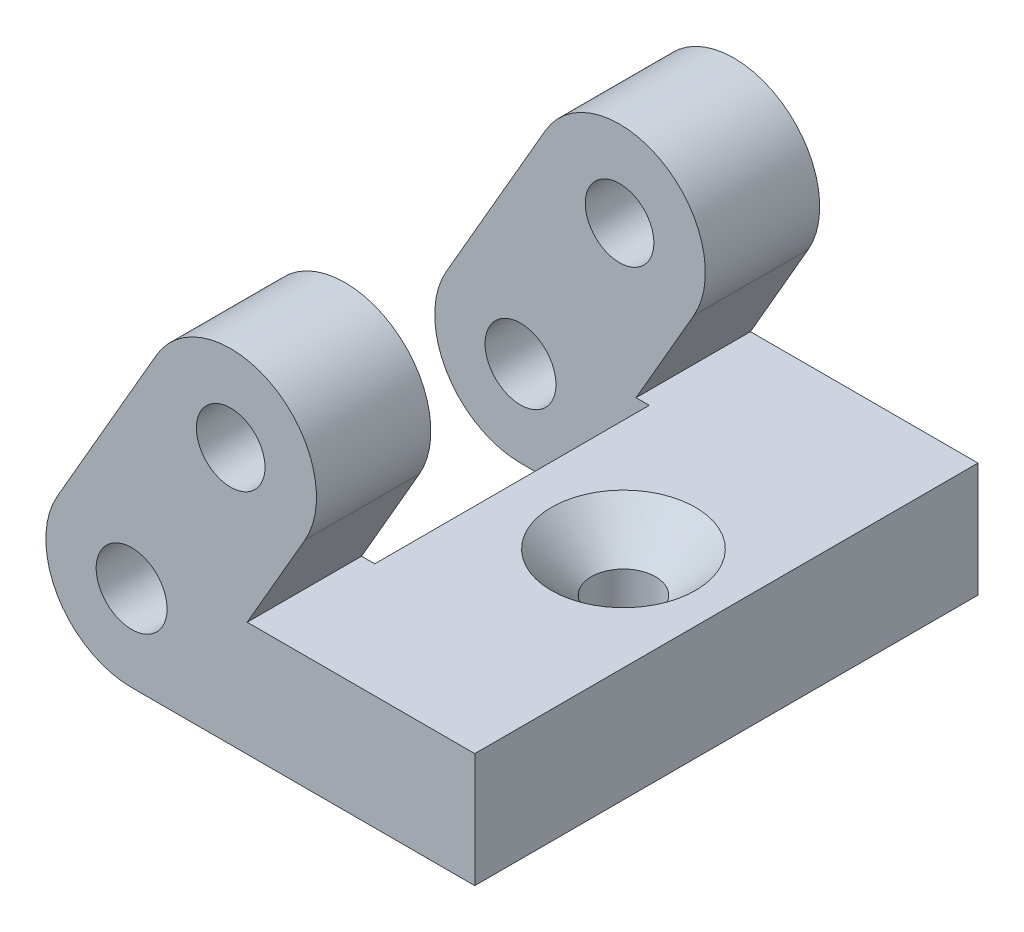
ISO-10303-21;
HEADER;
FILE_DESCRIPTION(('STEP AP214'),'2;1');
FILE_NAME('part.step','',(''),(''),'','','');
FILE_SCHEMA(('AUTOMOTIVE_DESIGN { 1 0 10303 214 1 1 1 1 }'));
ENDSEC;
DATA;
#1=APPLICATION_CONTEXT('core data for automotive mechanical design processes');
#2=APPLICATION_PROTOCOL_DEFINITION('international standard','automotive_design',2000,#1);
#3=PRODUCT_CONTEXT('',#1,'mechanical');
#4=PRODUCT('Part','Part','',(#3));
#5=PRODUCT_RELATED_PRODUCT_CATEGORY('part','',(#4));
#6=PRODUCT_DEFINITION_FORMATION('','',#4);
#7=PRODUCT_DEFINITION_CONTEXT('part definition',#1,'design');
#8=PRODUCT_DEFINITION('design','',#6,#7);
#9=PRODUCT_DEFINITION_SHAPE('','',#8);
#10=(LENGTH_UNIT() NAMED_UNIT(*) SI_UNIT(.MILLI.,.METRE.));
#11=(NAMED_UNIT(*) PLANE_ANGLE_UNIT() SI_UNIT($,.RADIAN.));
#12=(NAMED_UNIT(*) SI_UNIT($,.STERADIAN.) SOLID_ANGLE_UNIT());
#13=UNCERTAINTY_MEASURE_WITH_UNIT(LENGTH_MEASURE(1.E-05),#10,'distance_accuracy_value','');
#14=(GEOMETRIC_REPRESENTATION_CONTEXT(3) GLOBAL_UNCERTAINTY_ASSIGNED_CONTEXT((#13)) GLOBAL_UNIT_ASSIGNED_CONTEXT((#10,
#11,#12)) REPRESENTATION_CONTEXT('',''));
#15=CARTESIAN_POINT('',(0.,0.,0.));
#16=DIRECTION('',(0.,0.,1.));
#17=DIRECTION('',(1.,0.,0.));
#18=AXIS2_PLACEMENT_3D('',#15,#16,#17);
#19=CARTESIAN_POINT('',(4.33012701892224,7.5,-11.));
#20=DIRECTION('',(0.,0.,1.));
#21=DIRECTION('',(1.,0.,0.));
#22=AXIS2_PLACEMENT_3D('',#19,#20,#21);
#23=CYLINDRICAL_SURFACE('',#22,3.75);
#24=DIRECTION('',(0.,0.,1.));
#25=VECTOR('',#24,1.);
#26=CARTESIAN_POINT('',(1.0825317547306,9.37500000000002,-11.));
#27=LINE('',#26,#25);
#28=CARTESIAN_POINT('',(1.0825317547306,9.37500000000002,-11.));
#29=VERTEX_POINT('',#28);
#30=CARTESIAN_POINT('',(1.0825317547306,9.37500000000002,-6.));
#31=VERTEX_POINT('',#30);
#32=EDGE_CURVE('E284',#29,#31,#27,.T.);
#33=ORIENTED_EDGE('',*,*,#32,.T.);
#34=CARTESIAN_POINT('',(4.33012701892224,7.5,-6.));
#35=DIRECTION('',(0.,0.,1.));
#36=DIRECTION('',(1.,0.,0.));
#37=AXIS2_PLACEMENT_3D('',#34,#35,#36);
#38=CIRCLE('',#37,3.75);
#39=CARTESIAN_POINT('',(7.57772228311388,5.62499999999998,-6.));
#40=VERTEX_POINT('',#39);
#41=EDGE_CURVE('E201',#31,#40,#38,.F.);
#42=ORIENTED_EDGE('',*,*,#41,.T.);
#43=DIRECTION('',(0.,0.,1.));
#44=VECTOR('',#43,1.);
#45=CARTESIAN_POINT('',(7.57772228311388,5.62499999999998,-11.));
#46=LINE('',#45,#44);
#47=CARTESIAN_POINT('',(7.57772228311388,5.62499999999998,-11.));
#48=VERTEX_POINT('',#47);
#49=EDGE_CURVE('E264',#48,#40,#46,.T.);
#50=ORIENTED_EDGE('',*,*,#49,.F.);
#51=CARTESIAN_POINT('',(4.33012701892224,7.5,-11.));
#52=DIRECTION('',(0.,0.,1.));
#53=DIRECTION('',(-1.,0.,0.));
#54=AXIS2_PLACEMENT_3D('',#51,#52,#53);
#55=CIRCLE('',#54,3.75);
#56=EDGE_CURVE('E222',#48,#29,#55,.T.);
#57=ORIENTED_EDGE('',*,*,#56,.T.);
#58=EDGE_LOOP('',(#33,#42,#50,#57));
#59=FACE_BOUND('',#58,.T.);
#60=ADVANCED_FACE('F33',(#59),#23,.T.);
#61=CARTESIAN_POINT('',(5.05181485540925,1.25,-11.));
#62=DIRECTION('',(0.866025403784436,-0.500000000000004,0.));
#63=DIRECTION('',(0.500000000000004,0.866025403784436,0.));
#64=AXIS2_PLACEMENT_3D('',#61,#62,#63);
#65=PLANE('',#64);
#66=ORIENTED_EDGE('',*,*,#49,.T.);
#67=DIRECTION('',(-0.500000000000004,-0.866025403784436,0.));
#68=VECTOR('',#67,1.);
#69=CARTESIAN_POINT('',(5.05181485540925,1.25,-6.));
#70=LINE('',#69,#68);
#71=CARTESIAN_POINT('',(5.05181485540925,1.25,-6.));
#72=VERTEX_POINT('',#71);
#73=EDGE_CURVE('E204',#40,#72,#70,.T.);
#74=ORIENTED_EDGE('',*,*,#73,.T.);
#75=DIRECTION('',(0.,0.,1.));
#76=VECTOR('',#75,1.);
#77=CARTESIAN_POINT('',(5.05181485540925,1.25,-11.));
#78=LINE('',#77,#76);
#79=CARTESIAN_POINT('',(5.05181485540925,1.25,-11.));
#80=VERTEX_POINT('',#79);
#81=EDGE_CURVE('E268',#80,#72,#78,.T.);
#82=ORIENTED_EDGE('',*,*,#81,.F.);
#83=DIRECTION('',(0.500000000000004,0.866025403784436,0.));
#84=VECTOR('',#83,1.);
#85=CARTESIAN_POINT('',(5.05181485540925,1.25,-11.));
#86=LINE('',#85,#84);
#87=EDGE_CURVE('E241',#80,#48,#86,.T.);
#88=ORIENTED_EDGE('',*,*,#87,.T.);
#89=EDGE_LOOP('',(#66,#74,#82,#88));
#90=FACE_BOUND('',#89,.T.);
#91=ADVANCED_FACE('F320',(#90),#65,.T.);
#92=CARTESIAN_POINT('',(15.,1.25,-11.));
#93=DIRECTION('',(0.,1.,0.));
#94=DIRECTION('',(-1.,0.,0.));
#95=AXIS2_PLACEMENT_3D('',#92,#93,#94);
#96=PLANE('',#95);
#97=CARTESIAN_POINT('',(10.5,1.25,0.));
#98=DIRECTION('',(0.,1.,0.));
#99=DIRECTION('',(0.,0.,1.));
#100=AXIS2_PLACEMENT_3D('',#97,#98,#99);
#101=CIRCLE('',#100,3.15);
#102=CARTESIAN_POINT('',(10.5,1.25,3.15));
#103=VERTEX_POINT('',#102);
#104=EDGE_CURVE('E377',#103,#103,#101,.T.);
#105=ORIENTED_EDGE('',*,*,#104,.F.);
#106=EDGE_LOOP('',(#105));
#107=FACE_BOUND('',#106,.T.);
#108=ORIENTED_EDGE('',*,*,#81,.T.);
#109=DIRECTION('',(1.,0.,0.));
#110=VECTOR('',#109,1.);
#111=CARTESIAN_POINT('',(15.,1.25,-6.));
#112=LINE('',#111,#110);
#113=CARTESIAN_POINT('',(5.62916512459885,1.25,-6.));
#114=VERTEX_POINT('',#113);
#115=EDGE_CURVE('E207',#72,#114,#112,.T.);
#116=ORIENTED_EDGE('',*,*,#115,.T.);
#117=DIRECTION('',(0.,0.,-1.));
#118=VECTOR('',#117,1.);
#119=CARTESIAN_POINT('',(5.62916512459885,1.25,-11.));
#120=LINE('',#119,#118);
#121=CARTESIAN_POINT('',(5.62916512459885,1.25,6.));
#122=VERTEX_POINT('',#121);
#123=EDGE_CURVE('E169',#122,#114,#120,.T.);
#124=ORIENTED_EDGE('',*,*,#123,.F.);
#125=DIRECTION('',(1.,0.,0.));
#126=VECTOR('',#125,1.);
#127=CARTESIAN_POINT('',(15.,1.25,6.));
#128=LINE('',#127,#126);
#129=CARTESIAN_POINT('',(5.05181485540925,1.25,6.));
#130=VERTEX_POINT('',#129);
#131=EDGE_CURVE('E188',#130,#122,#128,.T.);
#132=ORIENTED_EDGE('',*,*,#131,.F.);
#133=CARTESIAN_POINT('',(5.05181485540925,1.25,11.));
#134=VERTEX_POINT('',#133);
#135=EDGE_CURVE('E271',#130,#134,#78,.T.);
#136=ORIENTED_EDGE('',*,*,#135,.T.);
#137=DIRECTION('',(-1.,0.,0.));
#138=VECTOR('',#137,1.);
#139=CARTESIAN_POINT('',(15.,1.25,11.));
#140=LINE('',#139,#138);
#141=CARTESIAN_POINT('',(15.,1.25,11.));
#142=VERTEX_POINT('',#141);
#143=EDGE_CURVE('E259',#142,#134,#140,.T.);
#144=ORIENTED_EDGE('',*,*,#143,.F.);
#145=DIRECTION('',(0.,0.,1.));
#146=VECTOR('',#145,1.);
#147=CARTESIAN_POINT('',(15.,1.25,-11.));
#148=LINE('',#147,#146);
#149=CARTESIAN_POINT('',(15.,1.25,-11.));
#150=VERTEX_POINT('',#149);
#151=EDGE_CURVE('E272',#150,#142,#148,.T.);
#152=ORIENTED_EDGE('',*,*,#151,.F.);
#153=DIRECTION('',(-1.,0.,0.));
#154=VECTOR('',#153,1.);
#155=CARTESIAN_POINT('',(15.,1.25,-11.));
#156=LINE('',#155,#154);
#157=EDGE_CURVE('E238',#150,#80,#156,.T.);
#158=ORIENTED_EDGE('',*,*,#157,.T.);
#159=EDGE_LOOP('',(#108,#116,#124,#132,#136,#144,#152,#158));
#160=FACE_BOUND('',#159,.T.);
#161=ADVANCED_FACE('F322',(#107,#160),#96,.T.);
#162=CARTESIAN_POINT('',(0.,-3.75,-11.));
#163=DIRECTION('',(0.,-1.,0.));
#164=DIRECTION('',(1.,0.,0.));
#165=AXIS2_PLACEMENT_3D('',#162,#163,#164);
#166=PLANE('',#165);
#167=CARTESIAN_POINT('',(10.5,-3.75,0.));
#168=DIRECTION('',(0.,-1.,0.));
#169=DIRECTION('',(1.,0.,0.));
#170=AXIS2_PLACEMENT_3D('',#167,#168,#169);
#171=CIRCLE('',#170,1.4);
#172=CARTESIAN_POINT('',(11.9,-3.75,0.));
#173=VERTEX_POINT('',#172);
#174=EDGE_CURVE('E174',#173,#173,#171,.T.);
#175=ORIENTED_EDGE('',*,*,#174,.F.);
#176=EDGE_LOOP('',(#175));
#177=FACE_BOUND('',#176,.T.);
#178=DIRECTION('',(-1.,0.,0.));
#179=VECTOR('',#178,1.);
#180=CARTESIAN_POINT('',(0.,-3.75,6.));
#181=LINE('',#180,#179);
#182=CARTESIAN_POINT('',(4.47213595499958,-3.75,6.));
#183=VERTEX_POINT('',#182);
#184=CARTESIAN_POINT('',(0.,-3.75,6.));
#185=VERTEX_POINT('',#184);
#186=EDGE_CURVE('E48',#183,#185,#181,.T.);
#187=ORIENTED_EDGE('',*,*,#186,.F.);
#188=DIRECTION('',(0.,0.,-1.));
#189=VECTOR('',#188,1.);
#190=CARTESIAN_POINT('',(4.47213595499958,-3.75,-6.));
#191=LINE('',#190,#189);
#192=CARTESIAN_POINT('',(4.47213595499958,-3.75,-6.));
#193=VERTEX_POINT('',#192);
#194=EDGE_CURVE('E297',#183,#193,#191,.T.);
#195=ORIENTED_EDGE('',*,*,#194,.T.);
#196=DIRECTION('',(-1.,0.,0.));
#197=VECTOR('',#196,1.);
#198=CARTESIAN_POINT('',(0.,-3.75,-6.));
#199=LINE('',#198,#197);
#200=CARTESIAN_POINT('',(0.,-3.75,-6.));
#201=VERTEX_POINT('',#200);
#202=EDGE_CURVE('E55',#193,#201,#199,.T.);
#203=ORIENTED_EDGE('',*,*,#202,.T.);
#204=DIRECTION('',(0.,0.,1.));
#205=VECTOR('',#204,1.);
#206=CARTESIAN_POINT('',(0.,-3.75,-11.));
#207=LINE('',#206,#205);
#208=CARTESIAN_POINT('',(0.,-3.75,-11.));
#209=VERTEX_POINT('',#208);
#210=EDGE_CURVE('E276',#209,#201,#207,.T.);
#211=ORIENTED_EDGE('',*,*,#210,.F.);
#212=DIRECTION('',(1.,0.,0.));
#213=VECTOR('',#212,1.);
#214=CARTESIAN_POINT('',(0.,-3.75,-11.));
#215=LINE('',#214,#213);
#216=CARTESIAN_POINT('',(15.,-3.75,-11.));
#217=VERTEX_POINT('',#216);
#218=EDGE_CURVE('E232',#209,#217,#215,.T.);
#219=ORIENTED_EDGE('',*,*,#218,.T.);
#220=DIRECTION('',(0.,0.,1.));
#221=VECTOR('',#220,1.);
#222=CARTESIAN_POINT('',(15.,-3.75,-11.));
#223=LINE('',#222,#221);
#224=CARTESIAN_POINT('',(15.,-3.75,11.));
#225=VERTEX_POINT('',#224);
#226=EDGE_CURVE('E274',#217,#225,#223,.T.);
#227=ORIENTED_EDGE('',*,*,#226,.T.);
#228=DIRECTION('',(1.,0.,0.));
#229=VECTOR('',#228,1.);
#230=CARTESIAN_POINT('',(0.,-3.75,11.));
#231=LINE('',#230,#229);
#232=CARTESIAN_POINT('',(0.,-3.75,11.));
#233=VERTEX_POINT('',#232);
#234=EDGE_CURVE('E253',#233,#225,#231,.T.);
#235=ORIENTED_EDGE('',*,*,#234,.F.);
#236=EDGE_CURVE('E279',#185,#233,#207,.T.);
#237=ORIENTED_EDGE('',*,*,#236,.F.);
#238=EDGE_LOOP('',(#187,#195,#203,#211,#219,#227,#235,#237));
#239=FACE_BOUND('',#238,.T.);
#240=ADVANCED_FACE('F304',(#177,#239),#166,.T.);
#241=CARTESIAN_POINT('',(0.,0.,-11.));
#242=DIRECTION('',(0.,0.,1.));
#243=DIRECTION('',(1.,0.,0.));
#244=AXIS2_PLACEMENT_3D('',#241,#242,#243);
#245=CYLINDRICAL_SURFACE('',#244,3.75);
#246=ORIENTED_EDGE('',*,*,#210,.T.);
#247=CARTESIAN_POINT('',(0.,0.,-6.));
#248=DIRECTION('',(0.,0.,1.));
#249=DIRECTION('',(1.,0.,0.));
#250=AXIS2_PLACEMENT_3D('',#247,#248,#249);
#251=CIRCLE('',#250,3.75);
#252=CARTESIAN_POINT('',(-3.24759526419164,1.87500000000002,-6.));
#253=VERTEX_POINT('',#252);
#254=EDGE_CURVE('E197',#201,#253,#251,.F.);
#255=ORIENTED_EDGE('',*,*,#254,.T.);
#256=DIRECTION('',(0.,0.,1.));
#257=VECTOR('',#256,1.);
#258=CARTESIAN_POINT('',(-3.24759526419164,1.87500000000002,-11.));
#259=LINE('',#258,#257);
#260=CARTESIAN_POINT('',(-3.24759526419164,1.87500000000002,-11.));
#261=VERTEX_POINT('',#260);
#262=EDGE_CURVE('E280',#261,#253,#259,.T.);
#263=ORIENTED_EDGE('',*,*,#262,.F.);
#264=CARTESIAN_POINT('',(0.,0.,-11.));
#265=DIRECTION('',(0.,0.,1.));
#266=DIRECTION('',(1.,0.,0.));
#267=AXIS2_PLACEMENT_3D('',#264,#265,#266);
#268=CIRCLE('',#267,3.75);
#269=EDGE_CURVE('E229',#261,#209,#268,.T.);
#270=ORIENTED_EDGE('',*,*,#269,.T.);
#271=EDGE_LOOP('',(#246,#255,#263,#270));
#272=FACE_BOUND('',#271,.T.);
#273=ADVANCED_FACE('F307',(#272),#245,.T.);
#274=CARTESIAN_POINT('',(1.0825317547306,9.37500000000002,-11.));
#275=DIRECTION('',(-0.866025403784436,0.500000000000004,0.));
#276=DIRECTION('',(-0.500000000000004,-0.866025403784436,0.));
#277=AXIS2_PLACEMENT_3D('',#274,#275,#276);
#278=PLANE('',#277);
#279=ORIENTED_EDGE('',*,*,#262,.T.);
#280=DIRECTION('',(0.500000000000004,0.866025403784436,0.));
#281=VECTOR('',#280,1.);
#282=CARTESIAN_POINT('',(1.0825317547306,9.37500000000002,-6.));
#283=LINE('',#282,#281);
#284=EDGE_CURVE('E194',#253,#31,#283,.T.);
#285=ORIENTED_EDGE('',*,*,#284,.T.);
#286=ORIENTED_EDGE('',*,*,#32,.F.);
#287=DIRECTION('',(-0.500000000000004,-0.866025403784436,0.));
#288=VECTOR('',#287,1.);
#289=CARTESIAN_POINT('',(1.0825317547306,9.37500000000002,-11.));
#290=LINE('',#289,#288);
#291=EDGE_CURVE('E225',#29,#261,#290,.T.);
#292=ORIENTED_EDGE('',*,*,#291,.T.);
#293=EDGE_LOOP('',(#279,#285,#286,#292));
#294=FACE_BOUND('',#293,.T.);
#295=ADVANCED_FACE('F315',(#294),#278,.T.);
#296=CARTESIAN_POINT('',(0.,0.,-11.));
#297=DIRECTION('',(0.,0.,1.));
#298=DIRECTION('',(1.,0.,0.));
#299=AXIS2_PLACEMENT_3D('',#296,#297,#298);
#300=CYLINDRICAL_SURFACE('',#299,1.55);
#301=CARTESIAN_POINT('',(0.,0.,-11.));
#302=DIRECTION('',(0.,0.,1.));
#303=DIRECTION('',(1.,0.,0.));
#304=AXIS2_PLACEMENT_3D('',#301,#302,#303);
#305=CIRCLE('',#304,1.55);
#306=CARTESIAN_POINT('',(1.55,0.,-11.));
#307=VERTEX_POINT('',#306);
#308=EDGE_CURVE('E216',#307,#307,#305,.T.);
#309=ORIENTED_EDGE('',*,*,#308,.F.);
#310=EDGE_LOOP('',(#309));
#311=FACE_BOUND('',#310,.T.);
#312=CARTESIAN_POINT('',(0.,0.,-6.));
#313=DIRECTION('',(0.,0.,1.));
#314=DIRECTION('',(1.,0.,0.));
#315=AXIS2_PLACEMENT_3D('',#312,#313,#314);
#316=CIRCLE('',#315,1.55);
#317=CARTESIAN_POINT('',(1.55,0.,-6.));
#318=VERTEX_POINT('',#317);
#319=EDGE_CURVE('E191',#318,#318,#316,.F.);
#320=ORIENTED_EDGE('',*,*,#319,.F.);
#321=EDGE_LOOP('',(#320));
#322=FACE_BOUND('',#321,.T.);
#323=ADVANCED_FACE('F412',(#311,#322),#300,.F.);
#324=CARTESIAN_POINT('',(4.33012701892224,7.5,-11.));
#325=DIRECTION('',(0.,0.,1.));
#326=DIRECTION('',(1.,0.,0.));
#327=AXIS2_PLACEMENT_3D('',#324,#325,#326);
#328=CYLINDRICAL_SURFACE('',#327,1.5);
#329=CARTESIAN_POINT('',(4.33012701892224,7.5,-11.));
#330=DIRECTION('',(0.,0.,1.));
#331=DIRECTION('',(1.,0.,0.));
#332=AXIS2_PLACEMENT_3D('',#329,#330,#331);
#333=CIRCLE('',#332,1.5);
#334=CARTESIAN_POINT('',(5.83012701892224,7.5,-11.));
#335=VERTEX_POINT('',#334);
#336=EDGE_CURVE('E210',#335,#335,#333,.T.);
#337=ORIENTED_EDGE('',*,*,#336,.F.);
#338=EDGE_LOOP('',(#337));
#339=FACE_BOUND('',#338,.T.);
#340=CARTESIAN_POINT('',(4.33012701892224,7.5,-6.));
#341=DIRECTION('',(0.,0.,1.));
#342=DIRECTION('',(1.,0.,0.));
#343=AXIS2_PLACEMENT_3D('',#340,#341,#342);
#344=CIRCLE('',#343,1.5);
#345=CARTESIAN_POINT('',(5.83012701892224,7.5,-6.));
#346=VERTEX_POINT('',#345);
#347=EDGE_CURVE('E190',#346,#346,#344,.F.);
#348=ORIENTED_EDGE('',*,*,#347,.F.);
#349=EDGE_LOOP('',(#348));
#350=FACE_BOUND('',#349,.T.);
#351=ADVANCED_FACE('F357',(#339,#350),#328,.F.);
#352=CARTESIAN_POINT('',(4.33012701892224,7.5,6.));
#353=DIRECTION('',(0.,0.,1.));
#354=DIRECTION('',(1.,0.,0.));
#355=AXIS2_PLACEMENT_3D('',#352,#353,#354);
#356=CIRCLE('',#355,3.75);
#357=CARTESIAN_POINT('',(1.0825317547306,9.37500000000002,6.));
#358=VERTEX_POINT('',#357);
#359=CARTESIAN_POINT('',(7.57772228311388,5.62499999999998,6.));
#360=VERTEX_POINT('',#359);
#361=EDGE_CURVE('E184',#358,#360,#356,.F.);
#362=ORIENTED_EDGE('',*,*,#361,.F.);
#363=CARTESIAN_POINT('',(1.0825317547306,9.37500000000002,11.));
#364=VERTEX_POINT('',#363);
#365=EDGE_CURVE('E244',#358,#364,#27,.T.);
#366=ORIENTED_EDGE('',*,*,#365,.T.);
#367=CARTESIAN_POINT('',(4.33012701892224,7.5,11.));
#368=DIRECTION('',(0.,0.,1.));
#369=DIRECTION('',(-1.,0.,0.));
#370=AXIS2_PLACEMENT_3D('',#367,#368,#369);
#371=CIRCLE('',#370,3.75);
#372=CARTESIAN_POINT('',(7.57772228311388,5.62499999999998,11.));
#373=VERTEX_POINT('',#372);
#374=EDGE_CURVE('E219',#373,#364,#371,.T.);
#375=ORIENTED_EDGE('',*,*,#374,.F.);
#376=EDGE_CURVE('E267',#360,#373,#46,.T.);
#377=ORIENTED_EDGE('',*,*,#376,.F.);
#378=EDGE_LOOP('',(#362,#366,#375,#377));
#379=FACE_BOUND('',#378,.T.);
#380=ADVANCED_FACE('F342',(#379),#23,.T.);
#381=DIRECTION('',(-0.500000000000004,-0.866025403784436,0.));
#382=VECTOR('',#381,1.);
#383=CARTESIAN_POINT('',(5.05181485540925,1.25,6.));
#384=LINE('',#383,#382);
#385=EDGE_CURVE('E186',#360,#130,#384,.T.);
#386=ORIENTED_EDGE('',*,*,#385,.F.);
#387=ORIENTED_EDGE('',*,*,#376,.T.);
#388=DIRECTION('',(0.500000000000004,0.866025403784436,0.));
#389=VECTOR('',#388,1.);
#390=CARTESIAN_POINT('',(5.05181485540925,1.25,11.));
#391=LINE('',#390,#389);
#392=EDGE_CURVE('E226',#134,#373,#391,.T.);
#393=ORIENTED_EDGE('',*,*,#392,.F.);
#394=ORIENTED_EDGE('',*,*,#135,.F.);
#395=EDGE_LOOP('',(#386,#387,#393,#394));
#396=FACE_BOUND('',#395,.T.);
#397=ADVANCED_FACE('F348',(#396),#65,.T.);
#398=CARTESIAN_POINT('',(15.,-3.75,-11.));
#399=DIRECTION('',(1.,0.,0.));
#400=DIRECTION('',(0.,0.,-1.));
#401=AXIS2_PLACEMENT_3D('',#398,#399,#400);
#402=PLANE('',#401);
#403=DIRECTION('',(0.,1.,0.));
#404=VECTOR('',#403,1.);
#405=CARTESIAN_POINT('',(15.,-3.75,11.));
#406=LINE('',#405,#404);
#407=EDGE_CURVE('E256',#225,#142,#406,.T.);
#408=ORIENTED_EDGE('',*,*,#407,.F.);
#409=ORIENTED_EDGE('',*,*,#226,.F.);
#410=DIRECTION('',(0.,1.,0.));
#411=VECTOR('',#410,1.);
#412=CARTESIAN_POINT('',(15.,-3.75,-11.));
#413=LINE('',#412,#411);
#414=EDGE_CURVE('E235',#217,#150,#413,.T.);
#415=ORIENTED_EDGE('',*,*,#414,.T.);
#416=ORIENTED_EDGE('',*,*,#151,.T.);
#417=EDGE_LOOP('',(#408,#409,#415,#416));
#418=FACE_BOUND('',#417,.T.);
#419=ADVANCED_FACE('F326',(#418),#402,.T.);
#420=CARTESIAN_POINT('',(0.,0.,6.));
#421=DIRECTION('',(0.,0.,1.));
#422=DIRECTION('',(1.,0.,0.));
#423=AXIS2_PLACEMENT_3D('',#420,#421,#422);
#424=CIRCLE('',#423,3.75);
#425=CARTESIAN_POINT('',(-3.24759526419164,1.87500000000002,6.));
#426=VERTEX_POINT('',#425);
#427=EDGE_CURVE('E181',#185,#426,#424,.F.);
#428=ORIENTED_EDGE('',*,*,#427,.F.);
#429=ORIENTED_EDGE('',*,*,#236,.T.);
#430=CARTESIAN_POINT('',(0.,0.,11.));
#431=DIRECTION('',(0.,0.,1.));
#432=DIRECTION('',(1.,0.,0.));
#433=AXIS2_PLACEMENT_3D('',#430,#431,#432);
#434=CIRCLE('',#433,3.75);
#435=CARTESIAN_POINT('',(-3.24759526419164,1.87500000000002,11.));
#436=VERTEX_POINT('',#435);
#437=EDGE_CURVE('E250',#436,#233,#434,.T.);
#438=ORIENTED_EDGE('',*,*,#437,.F.);
#439=EDGE_CURVE('E283',#426,#436,#259,.T.);
#440=ORIENTED_EDGE('',*,*,#439,.F.);
#441=EDGE_LOOP('',(#428,#429,#438,#440));
#442=FACE_BOUND('',#441,.T.);
#443=ADVANCED_FACE('F334',(#442),#245,.T.);
#444=DIRECTION('',(0.500000000000004,0.866025403784436,0.));
#445=VECTOR('',#444,1.);
#446=CARTESIAN_POINT('',(1.0825317547306,9.37500000000002,6.));
#447=LINE('',#446,#445);
#448=EDGE_CURVE('E179',#426,#358,#447,.T.);
#449=ORIENTED_EDGE('',*,*,#448,.F.);
#450=ORIENTED_EDGE('',*,*,#439,.T.);
#451=DIRECTION('',(-0.500000000000004,-0.866025403784436,0.));
#452=VECTOR('',#451,1.);
#453=CARTESIAN_POINT('',(1.0825317547306,9.37500000000002,11.));
#454=LINE('',#453,#452);
#455=EDGE_CURVE('E247',#364,#436,#454,.T.);
#456=ORIENTED_EDGE('',*,*,#455,.F.);
#457=ORIENTED_EDGE('',*,*,#365,.F.);
#458=EDGE_LOOP('',(#449,#450,#456,#457));
#459=FACE_BOUND('',#458,.T.);
#460=ADVANCED_FACE('F339',(#459),#278,.T.);
#461=CARTESIAN_POINT('',(4.33012701892224,7.5,-11.));
#462=DIRECTION('',(0.,0.,-1.));
#463=DIRECTION('',(-1.,0.,0.));
#464=AXIS2_PLACEMENT_3D('',#461,#462,#463);
#465=PLANE('',#464);
#466=ORIENTED_EDGE('',*,*,#336,.T.);
#467=EDGE_LOOP('',(#466));
#468=FACE_BOUND('',#467,.T.);
#469=ORIENTED_EDGE('',*,*,#308,.T.);
#470=EDGE_LOOP('',(#469));
#471=FACE_BOUND('',#470,.T.);
#472=ORIENTED_EDGE('',*,*,#56,.F.);
#473=ORIENTED_EDGE('',*,*,#87,.F.);
#474=ORIENTED_EDGE('',*,*,#157,.F.);
#475=ORIENTED_EDGE('',*,*,#414,.F.);
#476=ORIENTED_EDGE('',*,*,#218,.F.);
#477=ORIENTED_EDGE('',*,*,#269,.F.);
#478=ORIENTED_EDGE('',*,*,#291,.F.);
#479=EDGE_LOOP('',(#472,#473,#474,#475,#476,#477,#478));
#480=FACE_BOUND('',#479,.T.);
#481=ADVANCED_FACE('F312',(#468,#471,#480),#465,.T.);
#482=CARTESIAN_POINT('',(4.33012701892224,7.5,11.));
#483=DIRECTION('',(0.,0.,-1.));
#484=DIRECTION('',(-1.,0.,0.));
#485=AXIS2_PLACEMENT_3D('',#482,#483,#484);
#486=PLANE('',#485);
#487=CARTESIAN_POINT('',(4.33012701892224,7.5,11.));
#488=DIRECTION('',(0.,0.,1.));
#489=DIRECTION('',(1.,0.,0.));
#490=AXIS2_PLACEMENT_3D('',#487,#488,#489);
#491=CIRCLE('',#490,1.5);
#492=CARTESIAN_POINT('',(5.83012701892224,7.5,11.));
#493=VERTEX_POINT('',#492);
#494=EDGE_CURVE('E209',#493,#493,#491,.T.);
#495=ORIENTED_EDGE('',*,*,#494,.F.);
#496=EDGE_LOOP('',(#495));
#497=FACE_BOUND('',#496,.T.);
#498=CARTESIAN_POINT('',(0.,0.,11.));
#499=DIRECTION('',(0.,0.,1.));
#500=DIRECTION('',(1.,0.,0.));
#501=AXIS2_PLACEMENT_3D('',#498,#499,#500);
#502=CIRCLE('',#501,1.55);
#503=CARTESIAN_POINT('',(1.55,0.,11.));
#504=VERTEX_POINT('',#503);
#505=EDGE_CURVE('E213',#504,#504,#502,.T.);
#506=ORIENTED_EDGE('',*,*,#505,.F.);
#507=EDGE_LOOP('',(#506));
#508=FACE_BOUND('',#507,.T.);
#509=ORIENTED_EDGE('',*,*,#374,.T.);
#510=ORIENTED_EDGE('',*,*,#455,.T.);
#511=ORIENTED_EDGE('',*,*,#437,.T.);
#512=ORIENTED_EDGE('',*,*,#234,.T.);
#513=ORIENTED_EDGE('',*,*,#407,.T.);
#514=ORIENTED_EDGE('',*,*,#143,.T.);
#515=ORIENTED_EDGE('',*,*,#392,.T.);
#516=EDGE_LOOP('',(#509,#510,#511,#512,#513,#514,#515));
#517=FACE_BOUND('',#516,.T.);
#518=ADVANCED_FACE('F330',(#497,#508,#517),#486,.F.);
#519=CARTESIAN_POINT('',(0.,0.,6.));
#520=DIRECTION('',(0.,0.,1.));
#521=DIRECTION('',(1.,0.,0.));
#522=AXIS2_PLACEMENT_3D('',#519,#520,#521);
#523=CIRCLE('',#522,1.55);
#524=CARTESIAN_POINT('',(1.55,0.,6.));
#525=VERTEX_POINT('',#524);
#526=EDGE_CURVE('E176',#525,#525,#523,.F.);
#527=ORIENTED_EDGE('',*,*,#526,.T.);
#528=EDGE_LOOP('',(#527));
#529=FACE_BOUND('',#528,.T.);
#530=ORIENTED_EDGE('',*,*,#505,.T.);
#531=EDGE_LOOP('',(#530));
#532=FACE_BOUND('',#531,.T.);
#533=ADVANCED_FACE('F407',(#529,#532),#300,.F.);
#534=CARTESIAN_POINT('',(4.33012701892224,7.5,6.));
#535=DIRECTION('',(0.,0.,1.));
#536=DIRECTION('',(1.,0.,0.));
#537=AXIS2_PLACEMENT_3D('',#534,#535,#536);
#538=CIRCLE('',#537,1.5);
#539=CARTESIAN_POINT('',(5.83012701892224,7.5,6.));
#540=VERTEX_POINT('',#539);
#541=EDGE_CURVE('E165',#540,#540,#538,.F.);
#542=ORIENTED_EDGE('',*,*,#541,.T.);
#543=EDGE_LOOP('',(#542));
#544=FACE_BOUND('',#543,.T.);
#545=ORIENTED_EDGE('',*,*,#494,.T.);
#546=EDGE_LOOP('',(#545));
#547=FACE_BOUND('',#546,.T.);
#548=ADVANCED_FACE('F397',(#544,#547),#328,.F.);
#549=CARTESIAN_POINT('',(0.,0.,-6.));
#550=DIRECTION('',(0.,0.,1.));
#551=DIRECTION('',(1.,0.,0.));
#552=AXIS2_PLACEMENT_3D('',#549,#550,#551);
#553=PLANE('',#552);
#554=ORIENTED_EDGE('',*,*,#347,.T.);
#555=EDGE_LOOP('',(#554));
#556=FACE_BOUND('',#555,.T.);
#557=ORIENTED_EDGE('',*,*,#73,.F.);
#558=ORIENTED_EDGE('',*,*,#41,.F.);
#559=ORIENTED_EDGE('',*,*,#284,.F.);
#560=ORIENTED_EDGE('',*,*,#254,.F.);
#561=ORIENTED_EDGE('',*,*,#202,.F.);
#562=CARTESIAN_POINT('',(4.47213595499958,-2.75,-6.));
#563=DIRECTION('',(0.,0.,1.));
#564=DIRECTION('',(1.,0.,0.));
#565=AXIS2_PLACEMENT_3D('',#562,#563,#564);
#566=CIRCLE('',#565,1.);
#567=CARTESIAN_POINT('',(3.62030053499966,-2.22619047619048,-6.));
#568=VERTEX_POINT('',#567);
#569=EDGE_CURVE('E11',#193,#568,#566,.F.);
#570=ORIENTED_EDGE('',*,*,#569,.T.);
#571=CARTESIAN_POINT('',(0.,0.,-6.));
#572=DIRECTION('',(0.,0.,1.));
#573=DIRECTION('',(1.,0.,0.));
#574=AXIS2_PLACEMENT_3D('',#571,#572,#573);
#575=CIRCLE('',#574,4.25);
#576=CARTESIAN_POINT('',(3.68060796608386,-2.125,-6.));
#577=VERTEX_POINT('',#576);
#578=EDGE_CURVE('E144',#568,#577,#575,.T.);
#579=ORIENTED_EDGE('',*,*,#578,.T.);
#580=DIRECTION('',(0.5,0.866025403784439,0.));
#581=VECTOR('',#580,1.);
#582=CARTESIAN_POINT('',(13.3598428687312,14.6399266297792,-6.));
#583=LINE('',#582,#581);
#584=EDGE_CURVE('E149',#577,#114,#583,.T.);
#585=ORIENTED_EDGE('',*,*,#584,.T.);
#586=ORIENTED_EDGE('',*,*,#115,.F.);
#587=EDGE_LOOP('',(#557,#558,#559,#560,#561,#570,#579,#585,#586));
#588=FACE_BOUND('',#587,.T.);
#589=ORIENTED_EDGE('',*,*,#319,.T.);
#590=EDGE_LOOP('',(#589));
#591=FACE_BOUND('',#590,.T.);
#592=ADVANCED_FACE('F146',(#556,#588,#591),#553,.T.);
#593=CARTESIAN_POINT('',(0.,0.,6.));
#594=DIRECTION('',(0.,0.,1.));
#595=DIRECTION('',(1.,0.,0.));
#596=AXIS2_PLACEMENT_3D('',#593,#594,#595);
#597=PLANE('',#596);
#598=ORIENTED_EDGE('',*,*,#131,.T.);
#599=DIRECTION('',(0.5,0.866025403784439,0.));
#600=VECTOR('',#599,1.);
#601=CARTESIAN_POINT('',(13.3598428687312,14.6399266297792,6.));
#602=LINE('',#601,#600);
#603=CARTESIAN_POINT('',(3.68060796608386,-2.125,6.));
#604=VERTEX_POINT('',#603);
#605=EDGE_CURVE('E155',#604,#122,#602,.T.);
#606=ORIENTED_EDGE('',*,*,#605,.F.);
#607=CARTESIAN_POINT('',(0.,0.,6.));
#608=DIRECTION('',(0.,0.,1.));
#609=DIRECTION('',(1.,0.,0.));
#610=AXIS2_PLACEMENT_3D('',#607,#608,#609);
#611=CIRCLE('',#610,4.25);
#612=CARTESIAN_POINT('',(3.62030053499966,-2.22619047619048,6.));
#613=VERTEX_POINT('',#612);
#614=EDGE_CURVE('E161',#613,#604,#611,.T.);
#615=ORIENTED_EDGE('',*,*,#614,.F.);
#616=CARTESIAN_POINT('',(4.47213595499958,-2.75,6.));
#617=DIRECTION('',(0.,0.,1.));
#618=DIRECTION('',(1.,0.,0.));
#619=AXIS2_PLACEMENT_3D('',#616,#617,#618);
#620=CIRCLE('',#619,1.);
#621=EDGE_CURVE('E41',#613,#183,#620,.T.);
#622=ORIENTED_EDGE('',*,*,#621,.T.);
#623=ORIENTED_EDGE('',*,*,#186,.T.);
#624=ORIENTED_EDGE('',*,*,#427,.T.);
#625=ORIENTED_EDGE('',*,*,#448,.T.);
#626=ORIENTED_EDGE('',*,*,#361,.T.);
#627=ORIENTED_EDGE('',*,*,#385,.T.);
#628=EDGE_LOOP('',(#598,#606,#615,#622,#623,#624,#625,#626,#627));
#629=FACE_BOUND('',#628,.T.);
#630=ORIENTED_EDGE('',*,*,#541,.F.);
#631=EDGE_LOOP('',(#630));
#632=FACE_BOUND('',#631,.T.);
#633=ORIENTED_EDGE('',*,*,#526,.F.);
#634=EDGE_LOOP('',(#633));
#635=FACE_BOUND('',#634,.T.);
#636=ADVANCED_FACE('F300',(#629,#632,#635),#597,.F.);
#637=CARTESIAN_POINT('',(0.,0.,-6.));
#638=DIRECTION('',(0.,0.,1.));
#639=DIRECTION('',(1.,0.,0.));
#640=AXIS2_PLACEMENT_3D('',#637,#638,#639);
#641=CYLINDRICAL_SURFACE('',#640,4.25);
#642=ORIENTED_EDGE('',*,*,#578,.F.);
#643=DIRECTION('',(0.,0.,1.));
#644=VECTOR('',#643,1.);
#645=CARTESIAN_POINT('',(3.62030053499966,-2.22619047619048,-6.));
#646=LINE('',#645,#644);
#647=EDGE_CURVE('E292',#568,#613,#646,.T.);
#648=ORIENTED_EDGE('',*,*,#647,.T.);
#649=ORIENTED_EDGE('',*,*,#614,.T.);
#650=DIRECTION('',(0.,0.,1.));
#651=VECTOR('',#650,1.);
#652=CARTESIAN_POINT('',(3.68060796608386,-2.125,-6.));
#653=LINE('',#652,#651);
#654=EDGE_CURVE('E158',#577,#604,#653,.T.);
#655=ORIENTED_EDGE('',*,*,#654,.F.);
#656=EDGE_LOOP('',(#642,#648,#649,#655));
#657=FACE_BOUND('',#656,.T.);
#658=ADVANCED_FACE('F159',(#657),#641,.F.);
#659=CARTESIAN_POINT('',(13.3598428687312,14.6399266297792,-6.));
#660=DIRECTION('',(0.866025403784439,-0.5,0.));
#661=DIRECTION('',(0.5,0.866025403784439,0.));
#662=AXIS2_PLACEMENT_3D('',#659,#660,#661);
#663=PLANE('',#662);
#664=ORIENTED_EDGE('',*,*,#123,.T.);
#665=ORIENTED_EDGE('',*,*,#584,.F.);
#666=ORIENTED_EDGE('',*,*,#654,.T.);
#667=ORIENTED_EDGE('',*,*,#605,.T.);
#668=EDGE_LOOP('',(#664,#665,#666,#667));
#669=FACE_BOUND('',#668,.T.);
#670=ADVANCED_FACE('F167',(#669),#663,.F.);
#671=CARTESIAN_POINT('',(10.5,1.25,0.));
#672=DIRECTION('',(0.,1.,0.));
#673=DIRECTION('',(0.,0.,1.));
#674=AXIS2_PLACEMENT_3D('',#671,#672,#673);
#675=CYLINDRICAL_SURFACE('',#674,1.4);
#676=ORIENTED_EDGE('',*,*,#174,.T.);
#677=EDGE_LOOP('',(#676));
#678=FACE_BOUND('',#677,.T.);
#679=CARTESIAN_POINT('',(10.5,-0.500000000000001,0.));
#680=DIRECTION('',(0.,1.,0.));
#681=DIRECTION('',(0.,0.,1.));
#682=AXIS2_PLACEMENT_3D('',#679,#680,#681);
#683=CIRCLE('',#682,1.4);
#684=CARTESIAN_POINT('',(10.5,-0.500000000000001,1.4));
#685=VERTEX_POINT('',#684);
#686=EDGE_CURVE('E295',#685,#685,#683,.T.);
#687=ORIENTED_EDGE('',*,*,#686,.T.);
#688=EDGE_LOOP('',(#687));
#689=FACE_BOUND('',#688,.T.);
#690=ADVANCED_FACE('F383',(#678,#689),#675,.F.);
#691=CARTESIAN_POINT('',(10.5,1.25,0.));
#692=DIRECTION('',(0.,1.,0.));
#693=DIRECTION('',(0.,0.,1.));
#694=AXIS2_PLACEMENT_3D('',#691,#692,#693);
#695=CONICAL_SURFACE('',#694,3.15,0.785398163397448);
#696=ORIENTED_EDGE('',*,*,#686,.F.);
#697=EDGE_LOOP('',(#696));
#698=FACE_BOUND('',#697,.T.);
#699=ORIENTED_EDGE('',*,*,#104,.T.);
#700=EDGE_LOOP('',(#699));
#701=FACE_BOUND('',#700,.T.);
#702=ADVANCED_FACE('F385',(#698,#701),#695,.F.);
#703=CARTESIAN_POINT('',(4.47213595499958,-2.75,-6.));
#704=DIRECTION('',(0.,0.,1.));
#705=DIRECTION('',(1.,0.,0.));
#706=AXIS2_PLACEMENT_3D('',#703,#704,#705);
#707=CYLINDRICAL_SURFACE('',#706,1.);
#708=ORIENTED_EDGE('',*,*,#569,.F.);
#709=ORIENTED_EDGE('',*,*,#194,.F.);
#710=ORIENTED_EDGE('',*,*,#621,.F.);
#711=ORIENTED_EDGE('',*,*,#647,.F.);
#712=EDGE_LOOP('',(#708,#709,#710,#711));
#713=FACE_BOUND('',#712,.T.);
#714=ADVANCED_FACE('F35',(#713),#707,.T.);
#715=CLOSED_SHELL('',(#60,#91,#161,#240,#273,#295,#323,#351,#380,#397,#419,#443,#460,#481,#518,
#533,#548,#592,#636,#658,#670,#690,#702,#714));
#716=MANIFOLD_SOLID_BREP('B2',#715);
#717=ADVANCED_BREP_SHAPE_REPRESENTATION('',(#18,#716),#14);
#718=SHAPE_DEFINITION_REPRESENTATION(#9,#717);
ENDSEC;
END-ISO-10303-21;
